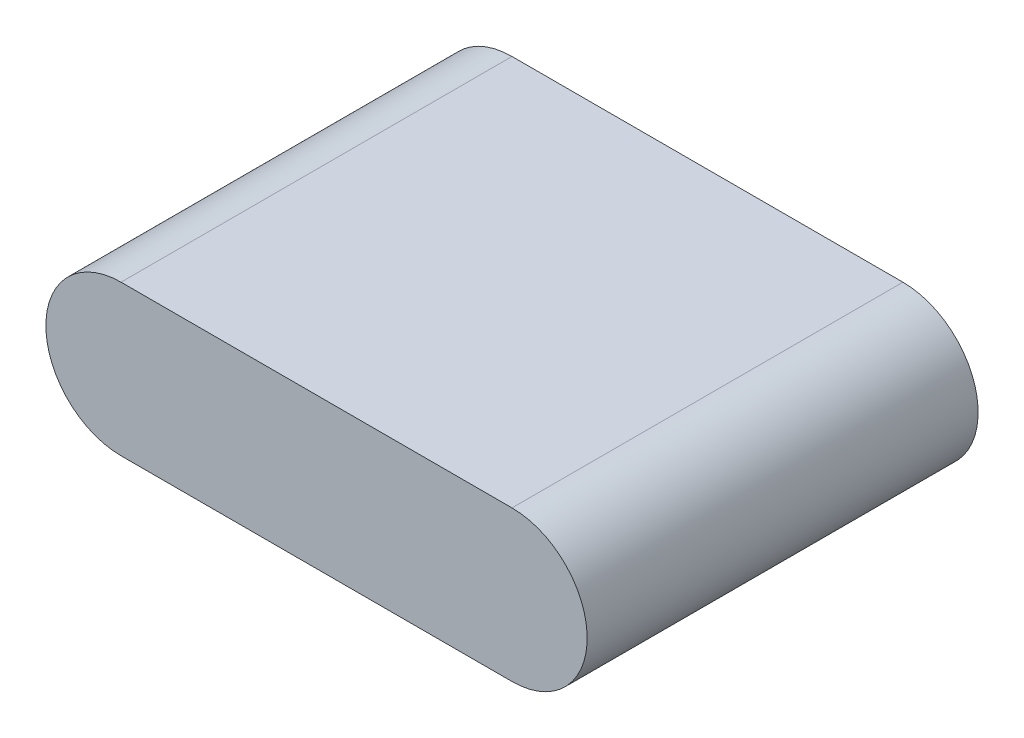
ISO-10303-21;
HEADER;
FILE_DESCRIPTION(('STEP AP214'),'2;1');
FILE_NAME('part.step','',(''),(''),'','','');
FILE_SCHEMA(('AUTOMOTIVE_DESIGN { 1 0 10303 214 1 1 1 1 }'));
ENDSEC;
DATA;
#1=APPLICATION_CONTEXT('core data for automotive mechanical design processes');
#2=APPLICATION_PROTOCOL_DEFINITION('international standard','automotive_design',2000,#1);
#3=PRODUCT_CONTEXT('',#1,'mechanical');
#4=PRODUCT('Part','Part','',(#3));
#5=PRODUCT_RELATED_PRODUCT_CATEGORY('part','',(#4));
#6=PRODUCT_DEFINITION_FORMATION('','',#4);
#7=PRODUCT_DEFINITION_CONTEXT('part definition',#1,'design');
#8=PRODUCT_DEFINITION('design','',#6,#7);
#9=PRODUCT_DEFINITION_SHAPE('','',#8);
#10=(LENGTH_UNIT() NAMED_UNIT(*) SI_UNIT(.MILLI.,.METRE.));
#11=(NAMED_UNIT(*) PLANE_ANGLE_UNIT() SI_UNIT($,.RADIAN.));
#12=(NAMED_UNIT(*) SI_UNIT($,.STERADIAN.) SOLID_ANGLE_UNIT());
#13=UNCERTAINTY_MEASURE_WITH_UNIT(LENGTH_MEASURE(1.E-05),#10,'distance_accuracy_value','');
#14=(GEOMETRIC_REPRESENTATION_CONTEXT(3) GLOBAL_UNCERTAINTY_ASSIGNED_CONTEXT((#13)) GLOBAL_UNIT_ASSIGNED_CONTEXT((#10,
#11,#12)) REPRESENTATION_CONTEXT('',''));
#15=CARTESIAN_POINT('',(0.,0.,0.));
#16=DIRECTION('',(0.,0.,1.));
#17=DIRECTION('',(1.,0.,0.));
#18=AXIS2_PLACEMENT_3D('',#15,#16,#17);
#19=CARTESIAN_POINT('',(0.,0.,78.));
#20=DIRECTION('',(0.,0.,-1.));
#21=DIRECTION('',(-1.,0.,0.));
#22=AXIS2_PLACEMENT_3D('',#19,#20,#21);
#23=CYLINDRICAL_SURFACE('',#22,15.);
#24=CARTESIAN_POINT('',(0.,0.,0.));
#25=DIRECTION('',(0.,0.,1.));
#26=DIRECTION('',(1.,0.,0.));
#27=AXIS2_PLACEMENT_3D('',#24,#25,#26);
#28=CIRCLE('',#27,15.);
#29=CARTESIAN_POINT('',(0.,15.,0.));
#30=VERTEX_POINT('',#29);
#31=CARTESIAN_POINT('',(0.,-15.,0.));
#32=VERTEX_POINT('',#31);
#33=EDGE_CURVE('E99',#30,#32,#28,.T.);
#34=ORIENTED_EDGE('',*,*,#33,.T.);
#35=DIRECTION('',(0.,0.,-1.));
#36=VECTOR('',#35,1.);
#37=CARTESIAN_POINT('',(0.,-15.,78.));
#38=LINE('',#37,#36);
#39=CARTESIAN_POINT('',(0.,-15.,78.));
#40=VERTEX_POINT('',#39);
#41=EDGE_CURVE('E11',#40,#32,#38,.T.);
#42=ORIENTED_EDGE('',*,*,#41,.F.);
#43=CARTESIAN_POINT('',(0.,0.,78.));
#44=DIRECTION('',(0.,0.,1.));
#45=DIRECTION('',(1.,0.,0.));
#46=AXIS2_PLACEMENT_3D('',#43,#44,#45);
#47=CIRCLE('',#46,15.);
#48=CARTESIAN_POINT('',(0.,15.,78.));
#49=VERTEX_POINT('',#48);
#50=EDGE_CURVE('E87',#49,#40,#47,.T.);
#51=ORIENTED_EDGE('',*,*,#50,.F.);
#52=DIRECTION('',(0.,0.,-1.));
#53=VECTOR('',#52,1.);
#54=CARTESIAN_POINT('',(0.,15.,78.));
#55=LINE('',#54,#53);
#56=EDGE_CURVE('E95',#49,#30,#55,.T.);
#57=ORIENTED_EDGE('',*,*,#56,.T.);
#58=EDGE_LOOP('',(#34,#42,#51,#57));
#59=FACE_BOUND('',#58,.T.);
#60=ADVANCED_FACE('F36',(#59),#23,.T.);
#61=CARTESIAN_POINT('',(0.,-15.,78.));
#62=DIRECTION('',(0.,1.,0.));
#63=DIRECTION('',(0.,0.,1.));
#64=AXIS2_PLACEMENT_3D('',#61,#62,#63);
#65=PLANE('',#64);
#66=DIRECTION('',(1.,0.,0.));
#67=VECTOR('',#66,1.);
#68=CARTESIAN_POINT('',(0.,-15.,0.));
#69=LINE('',#68,#67);
#70=CARTESIAN_POINT('',(78.,-15.,0.));
#71=VERTEX_POINT('',#70);
#72=EDGE_CURVE('E91',#32,#71,#69,.T.);
#73=ORIENTED_EDGE('',*,*,#72,.T.);
#74=DIRECTION('',(0.,0.,-1.));
#75=VECTOR('',#74,1.);
#76=CARTESIAN_POINT('',(78.,-15.,78.));
#77=LINE('',#76,#75);
#78=CARTESIAN_POINT('',(78.,-15.,78.));
#79=VERTEX_POINT('',#78);
#80=EDGE_CURVE('E44',#79,#71,#77,.T.);
#81=ORIENTED_EDGE('',*,*,#80,.F.);
#82=DIRECTION('',(1.,0.,0.));
#83=VECTOR('',#82,1.);
#84=CARTESIAN_POINT('',(0.,-15.,78.));
#85=LINE('',#84,#83);
#86=EDGE_CURVE('E82',#40,#79,#85,.T.);
#87=ORIENTED_EDGE('',*,*,#86,.F.);
#88=ORIENTED_EDGE('',*,*,#41,.T.);
#89=EDGE_LOOP('',(#73,#81,#87,#88));
#90=FACE_BOUND('',#89,.T.);
#91=ADVANCED_FACE('F90',(#90),#65,.F.);
#92=CARTESIAN_POINT('',(78.,0.,78.));
#93=DIRECTION('',(0.,0.,-1.));
#94=DIRECTION('',(-1.,0.,0.));
#95=AXIS2_PLACEMENT_3D('',#92,#93,#94);
#96=CYLINDRICAL_SURFACE('',#95,15.);
#97=CARTESIAN_POINT('',(78.,0.,0.));
#98=DIRECTION('',(0.,0.,1.));
#99=DIRECTION('',(1.,0.,0.));
#100=AXIS2_PLACEMENT_3D('',#97,#98,#99);
#101=CIRCLE('',#100,15.);
#102=CARTESIAN_POINT('',(78.,15.,0.));
#103=VERTEX_POINT('',#102);
#104=EDGE_CURVE('E69',#71,#103,#101,.T.);
#105=ORIENTED_EDGE('',*,*,#104,.T.);
#106=DIRECTION('',(0.,0.,-1.));
#107=VECTOR('',#106,1.);
#108=CARTESIAN_POINT('',(78.,15.,78.));
#109=LINE('',#108,#107);
#110=CARTESIAN_POINT('',(78.,15.,78.));
#111=VERTEX_POINT('',#110);
#112=EDGE_CURVE('E92',#111,#103,#109,.T.);
#113=ORIENTED_EDGE('',*,*,#112,.F.);
#114=CARTESIAN_POINT('',(78.,0.,78.));
#115=DIRECTION('',(0.,0.,1.));
#116=DIRECTION('',(1.,0.,0.));
#117=AXIS2_PLACEMENT_3D('',#114,#115,#116);
#118=CIRCLE('',#117,15.);
#119=EDGE_CURVE('E85',#79,#111,#118,.T.);
#120=ORIENTED_EDGE('',*,*,#119,.F.);
#121=ORIENTED_EDGE('',*,*,#80,.T.);
#122=EDGE_LOOP('',(#105,#113,#120,#121));
#123=FACE_BOUND('',#122,.T.);
#124=ADVANCED_FACE('F93',(#123),#96,.T.);
#125=CARTESIAN_POINT('',(0.,15.,78.));
#126=DIRECTION('',(0.,-1.,0.));
#127=DIRECTION('',(0.,0.,-1.));
#128=AXIS2_PLACEMENT_3D('',#125,#126,#127);
#129=PLANE('',#128);
#130=DIRECTION('',(-1.,0.,0.));
#131=VECTOR('',#130,1.);
#132=CARTESIAN_POINT('',(0.,15.,0.));
#133=LINE('',#132,#131);
#134=EDGE_CURVE('E75',#103,#30,#133,.T.);
#135=ORIENTED_EDGE('',*,*,#134,.T.);
#136=ORIENTED_EDGE('',*,*,#56,.F.);
#137=DIRECTION('',(-1.,0.,0.));
#138=VECTOR('',#137,1.);
#139=CARTESIAN_POINT('',(0.,15.,78.));
#140=LINE('',#139,#138);
#141=EDGE_CURVE('E52',#111,#49,#140,.T.);
#142=ORIENTED_EDGE('',*,*,#141,.F.);
#143=ORIENTED_EDGE('',*,*,#112,.T.);
#144=EDGE_LOOP('',(#135,#136,#142,#143));
#145=FACE_BOUND('',#144,.T.);
#146=ADVANCED_FACE('F106',(#145),#129,.F.);
#147=CARTESIAN_POINT('',(0.,0.,78.));
#148=DIRECTION('',(0.,0.,1.));
#149=DIRECTION('',(1.,0.,0.));
#150=AXIS2_PLACEMENT_3D('',#147,#148,#149);
#151=PLANE('',#150);
#152=ORIENTED_EDGE('',*,*,#50,.T.);
#153=ORIENTED_EDGE('',*,*,#86,.T.);
#154=ORIENTED_EDGE('',*,*,#119,.T.);
#155=ORIENTED_EDGE('',*,*,#141,.T.);
#156=EDGE_LOOP('',(#152,#153,#154,#155));
#157=FACE_BOUND('',#156,.T.);
#158=ADVANCED_FACE('F83',(#157),#151,.T.);
#159=CARTESIAN_POINT('',(0.,0.,0.));
#160=DIRECTION('',(0.,0.,1.));
#161=DIRECTION('',(1.,0.,0.));
#162=AXIS2_PLACEMENT_3D('',#159,#160,#161);
#163=PLANE('',#162);
#164=ORIENTED_EDGE('',*,*,#33,.F.);
#165=ORIENTED_EDGE('',*,*,#134,.F.);
#166=ORIENTED_EDGE('',*,*,#104,.F.);
#167=ORIENTED_EDGE('',*,*,#72,.F.);
#168=EDGE_LOOP('',(#164,#165,#166,#167));
#169=FACE_BOUND('',#168,.T.);
#170=ADVANCED_FACE('F109',(#169),#163,.F.);
#171=CLOSED_SHELL('',(#60,#91,#124,#146,#158,#170));
#172=MANIFOLD_SOLID_BREP('B2',#171);
#173=ADVANCED_BREP_SHAPE_REPRESENTATION('',(#18,#172),#14);
#174=SHAPE_DEFINITION_REPRESENTATION(#9,#173);
ENDSEC;
END-ISO-10303-21;
